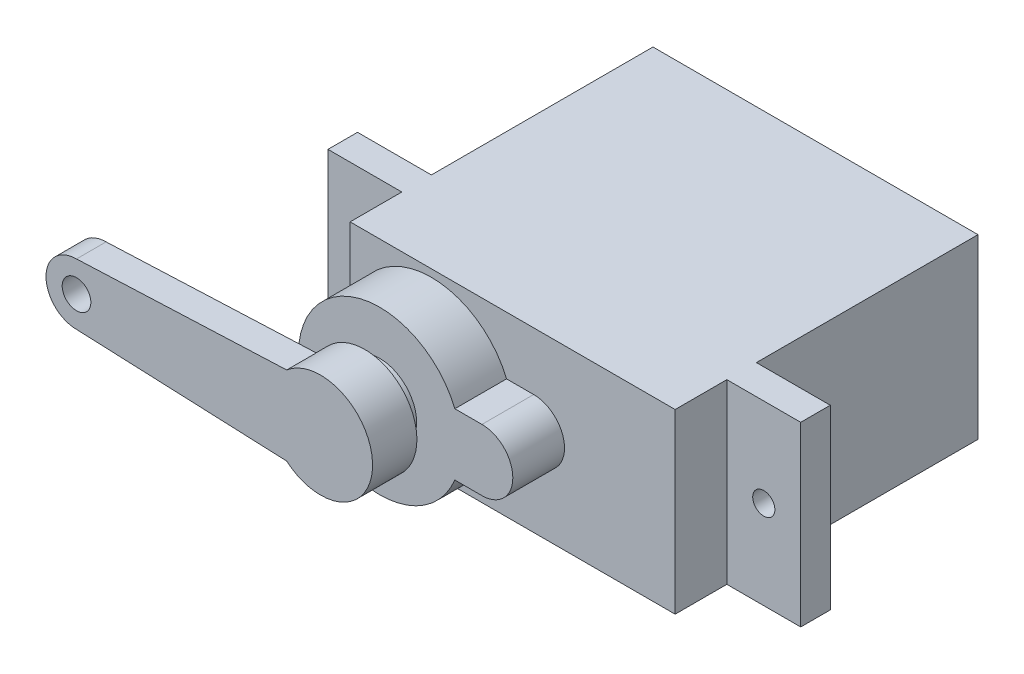
ISO-10303-21;
HEADER;
FILE_DESCRIPTION(('STEP AP214'),'2;1');
FILE_NAME('part.step','',(''),(''),'','','');
FILE_SCHEMA(('AUTOMOTIVE_DESIGN { 1 0 10303 214 1 1 1 1 }'));
ENDSEC;
DATA;
#1=APPLICATION_CONTEXT('core data for automotive mechanical design processes');
#2=APPLICATION_PROTOCOL_DEFINITION('international standard','automotive_design',2000,#1);
#3=PRODUCT_CONTEXT('',#1,'mechanical');
#4=PRODUCT('Part','Part','',(#3));
#5=PRODUCT_RELATED_PRODUCT_CATEGORY('part','',(#4));
#6=PRODUCT_DEFINITION_FORMATION('','',#4);
#7=PRODUCT_DEFINITION_CONTEXT('part definition',#1,'design');
#8=PRODUCT_DEFINITION('design','',#6,#7);
#9=PRODUCT_DEFINITION_SHAPE('','',#8);
#10=(LENGTH_UNIT() NAMED_UNIT(*) SI_UNIT(.MILLI.,.METRE.));
#11=(NAMED_UNIT(*) PLANE_ANGLE_UNIT() SI_UNIT($,.RADIAN.));
#12=(NAMED_UNIT(*) SI_UNIT($,.STERADIAN.) SOLID_ANGLE_UNIT());
#13=UNCERTAINTY_MEASURE_WITH_UNIT(LENGTH_MEASURE(1.E-05),#10,'distance_accuracy_value','');
#14=(GEOMETRIC_REPRESENTATION_CONTEXT(3) GLOBAL_UNCERTAINTY_ASSIGNED_CONTEXT((#13)) GLOBAL_UNIT_ASSIGNED_CONTEXT((#10,
#11,#12)) REPRESENTATION_CONTEXT('',''));
#15=CARTESIAN_POINT('',(0.,0.,0.));
#16=DIRECTION('',(0.,0.,1.));
#17=DIRECTION('',(1.,0.,0.));
#18=AXIS2_PLACEMENT_3D('',#15,#16,#17);
#19=CARTESIAN_POINT('',(-10.8451712141979,26.1223214401039,14.1474305796321));
#20=DIRECTION('',(0.,-3.38569450253345E-13,1.));
#21=DIRECTION('',(0.,-1.,-3.38569450253345E-13));
#22=AXIS2_PLACEMENT_3D('',#19,#20,#21);
#23=CYLINDRICAL_SURFACE('',#22,3.52);
#24=CARTESIAN_POINT('',(-10.8451712141979,26.1223214401039,14.1474305796321));
#25=DIRECTION('',(0.,-3.38569450253345E-13,1.));
#26=DIRECTION('',(0.,-1.,-3.38569450253345E-13));
#27=AXIS2_PLACEMENT_3D('',#24,#25,#26);
#28=CIRCLE('',#27,3.52);
#29=CARTESIAN_POINT('',(-10.8451712141979,22.6023214401039,14.1474305796309));
#30=VERTEX_POINT('',#29);
#31=EDGE_CURVE('E259',#30,#30,#28,.T.);
#32=ORIENTED_EDGE('',*,*,#31,.T.);
#33=EDGE_LOOP('',(#32));
#34=FACE_BOUND('',#33,.T.);
#35=CARTESIAN_POINT('',(-10.8451712141979,26.1223214401028,17.1474305796321));
#36=DIRECTION('',(0.,-3.38569450253345E-13,1.));
#37=DIRECTION('',(0.,-1.,-3.38569450253345E-13));
#38=AXIS2_PLACEMENT_3D('',#35,#36,#37);
#39=CIRCLE('',#38,3.52);
#40=CARTESIAN_POINT('',(-13.1377621669424,23.4512866736885,17.1474305796312));
#41=VERTEX_POINT('',#40);
#42=CARTESIAN_POINT('',(-13.1377621669553,28.7933562065052,17.1474305796233));
#43=VERTEX_POINT('',#42);
#44=EDGE_CURVE('E257',#41,#43,#39,.T.);
#45=ORIENTED_EDGE('',*,*,#44,.F.);
#46=DIRECTION('',(0.,0.,1.));
#47=VECTOR('',#46,1.);
#48=CARTESIAN_POINT('',(-13.1377621669486,23.4512866736888,15.1474305796233));
#49=LINE('',#48,#47);
#50=CARTESIAN_POINT('',(-13.1377621669486,23.4512866736888,15.1474305796233));
#51=VERTEX_POINT('',#50);
#52=EDGE_CURVE('E681',#51,#41,#49,.T.);
#53=ORIENTED_EDGE('',*,*,#52,.F.);
#54=CARTESIAN_POINT('',(-10.8451712141945,26.1223214400999,15.1474305796233));
#55=DIRECTION('',(0.,0.,1.));
#56=DIRECTION('',(1.,0.,0.));
#57=AXIS2_PLACEMENT_3D('',#54,#55,#56);
#58=CIRCLE('',#57,3.52000000000378);
#59=CARTESIAN_POINT('',(-13.1377621669553,28.7933562065052,15.1474305796233));
#60=VERTEX_POINT('',#59);
#61=EDGE_CURVE('E239',#60,#51,#58,.T.);
#62=ORIENTED_EDGE('',*,*,#61,.F.);
#63=DIRECTION('',(0.,0.,1.));
#64=VECTOR('',#63,1.);
#65=CARTESIAN_POINT('',(-13.1377621669553,28.7933562065052,15.1474305796233));
#66=LINE('',#65,#64);
#67=EDGE_CURVE('E250',#60,#43,#66,.T.);
#68=ORIENTED_EDGE('',*,*,#67,.T.);
#69=EDGE_LOOP('',(#45,#53,#62,#68));
#70=FACE_BOUND('',#69,.T.);
#71=ADVANCED_FACE('F79',(#34,#70),#23,.T.);
#72=CARTESIAN_POINT('',(-10.8451712141979,26.1223214401039,14.1474305796321));
#73=DIRECTION('',(0.,-3.38569450253345E-13,1.));
#74=DIRECTION('',(0.,-1.,-3.38569450253345E-13));
#75=AXIS2_PLACEMENT_3D('',#72,#73,#74);
#76=PLANE('',#75);
#77=CARTESIAN_POINT('',(-10.8451712141979,26.1223214401039,14.1474305796321));
#78=DIRECTION('',(0.,-3.38569450253345E-13,1.));
#79=DIRECTION('',(0.,-1.,-3.38569450253345E-13));
#80=AXIS2_PLACEMENT_3D('',#77,#78,#79);
#81=CIRCLE('',#80,2.5);
#82=CARTESIAN_POINT('',(-10.8451712141979,23.6223214401039,14.1474305796313));
#83=VERTEX_POINT('',#82);
#84=EDGE_CURVE('E12',#83,#83,#81,.T.);
#85=ORIENTED_EDGE('',*,*,#84,.T.);
#86=EDGE_LOOP('',(#85));
#87=FACE_BOUND('',#86,.T.);
#88=ORIENTED_EDGE('',*,*,#31,.F.);
#89=EDGE_LOOP('',(#88));
#90=FACE_BOUND('',#89,.T.);
#91=ADVANCED_FACE('F474',(#87,#90),#76,.F.);
#92=CARTESIAN_POINT('',(-10.8451712141979,26.1223214401028,17.1474305796321));
#93=DIRECTION('',(0.,-3.38569450253345E-13,1.));
#94=DIRECTION('',(0.,-1.,-3.38569450253345E-13));
#95=AXIS2_PLACEMENT_3D('',#92,#93,#94);
#96=PLANE('',#95);
#97=CARTESIAN_POINT('',(-27.3651712142003,26.1223214400971,17.1474305796233));
#98=DIRECTION('',(0.,0.,1.));
#99=DIRECTION('',(1.,0.,0.));
#100=AXIS2_PLACEMENT_3D('',#97,#98,#99);
#101=CIRCLE('',#100,0.969999999999998);
#102=CARTESIAN_POINT('',(-26.3951712142003,26.1223214400971,17.1474305796233));
#103=VERTEX_POINT('',#102);
#104=EDGE_CURVE('E675',#103,#103,#101,.T.);
#105=ORIENTED_EDGE('',*,*,#104,.F.);
#106=EDGE_LOOP('',(#105));
#107=FACE_BOUND('',#106,.T.);
#108=ORIENTED_EDGE('',*,*,#44,.T.);
#109=DIRECTION('',(-0.999095832776536,-0.0425149024291429,0.));
#110=VECTOR('',#109,1.);
#111=CARTESIAN_POINT('',(-13.1377621669553,28.7933562065052,17.1474305796233));
#112=LINE('',#111,#110);
#113=CARTESIAN_POINT('',(-27.3651712142037,28.1879318942225,17.1474305796233));
#114=VERTEX_POINT('',#113);
#115=EDGE_CURVE('E242',#43,#114,#112,.T.);
#116=ORIENTED_EDGE('',*,*,#115,.T.);
#117=CARTESIAN_POINT('',(-27.3651712142003,26.1223214400971,17.1474305796233));
#118=DIRECTION('',(0.,0.,-1.));
#119=DIRECTION('',(-1.,0.,0.));
#120=AXIS2_PLACEMENT_3D('',#117,#118,#119);
#121=CIRCLE('',#120,2.06561045412541);
#122=CARTESIAN_POINT('',(-27.365171214197,24.0567109859717,17.1474305796233));
#123=VERTEX_POINT('',#122);
#124=EDGE_CURVE('E683',#123,#114,#121,.T.);
#125=ORIENTED_EDGE('',*,*,#124,.F.);
#126=DIRECTION('',(-0.999095832776536,0.0425149024291534,0.));
#127=VECTOR('',#126,1.);
#128=CARTESIAN_POINT('',(-13.1377621669485,23.4512866736888,17.1474305796233));
#129=LINE('',#128,#127);
#130=EDGE_CURVE('E96',#41,#123,#129,.T.);
#131=ORIENTED_EDGE('',*,*,#130,.F.);
#132=EDGE_LOOP('',(#108,#116,#125,#131));
#133=FACE_BOUND('',#132,.T.);
#134=ADVANCED_FACE('F481',(#107,#133),#96,.T.);
#135=CARTESIAN_POINT('',(-10.8451712141979,26.1223214401032,16.1474305796321));
#136=DIRECTION('',(0.,3.38569450253345E-13,-1.));
#137=DIRECTION('',(0.,1.,3.38569450253345E-13));
#138=AXIS2_PLACEMENT_3D('',#135,#136,#137);
#139=CYLINDRICAL_SURFACE('',#138,2.5);
#140=CARTESIAN_POINT('',(-10.8451712141979,26.1223214401042,13.1474305796321));
#141=DIRECTION('',(0.,-3.38569450253345E-13,1.));
#142=DIRECTION('',(0.,-1.,-3.38569450253345E-13));
#143=AXIS2_PLACEMENT_3D('',#140,#141,#142);
#144=CIRCLE('',#143,2.5);
#145=CARTESIAN_POINT('',(-10.8451712141979,23.6223214401042,13.1474305796313));
#146=VERTEX_POINT('',#145);
#147=EDGE_CURVE('E88',#146,#146,#144,.T.);
#148=ORIENTED_EDGE('',*,*,#147,.T.);
#149=EDGE_LOOP('',(#148));
#150=FACE_BOUND('',#149,.T.);
#151=ORIENTED_EDGE('',*,*,#84,.F.);
#152=EDGE_LOOP('',(#151));
#153=FACE_BOUND('',#152,.T.);
#154=ADVANCED_FACE('F487',(#150,#153),#139,.T.);
#155=CARTESIAN_POINT('',(-5.34517121419788,66.4455640076976,6.14743057964577));
#156=DIRECTION('',(0.,3.38569450253345E-13,-1.));
#157=DIRECTION('',(0.,1.,3.38569450253345E-13));
#158=AXIS2_PLACEMENT_3D('',#155,#156,#157);
#159=PLANE('',#158);
#160=CARTESIAN_POINT('',(-18.8451712141979,26.1223214401066,6.14743057963212));
#161=DIRECTION('',(0.,-3.38569450253345E-13,1.));
#162=DIRECTION('',(0.,-1.,-3.38569450253345E-13));
#163=AXIS2_PLACEMENT_3D('',#160,#161,#162);
#164=CIRCLE('',#163,0.75);
#165=CARTESIAN_POINT('',(-18.8451712141979,25.3723214401066,6.14743057963186));
#166=VERTEX_POINT('',#165);
#167=EDGE_CURVE('E248',#166,#166,#164,.T.);
#168=ORIENTED_EDGE('',*,*,#167,.F.);
#169=EDGE_LOOP('',(#168));
#170=FACE_BOUND('',#169,.T.);
#171=DIRECTION('',(0.,-1.,-3.38569450253345E-13));
#172=VECTOR('',#171,1.);
#173=CARTESIAN_POINT('',(-16.3451712141979,32.1223214401066,6.14743057963414));
#174=LINE('',#173,#172);
#175=CARTESIAN_POINT('',(-16.3451712141979,32.1223214401066,6.14743057963414));
#176=VERTEX_POINT('',#175);
#177=CARTESIAN_POINT('',(-16.3451712141979,20.1223214401066,6.14743057963008));
#178=VERTEX_POINT('',#177);
#179=EDGE_CURVE('E295',#176,#178,#174,.T.);
#180=ORIENTED_EDGE('',*,*,#179,.F.);
#181=DIRECTION('',(-1.,0.,0.));
#182=VECTOR('',#181,1.);
#183=CARTESIAN_POINT('',(-16.3451712141979,32.1223214401066,6.14743057963414));
#184=LINE('',#183,#182);
#185=CARTESIAN_POINT('',(-21.3451712141979,32.1223214401066,6.14743057963414));
#186=VERTEX_POINT('',#185);
#187=EDGE_CURVE('E326',#176,#186,#184,.T.);
#188=ORIENTED_EDGE('',*,*,#187,.T.);
#189=DIRECTION('',(0.,-1.,-3.38569450253345E-13));
#190=VECTOR('',#189,1.);
#191=CARTESIAN_POINT('',(-21.3451712141979,32.1223214401066,6.14743057963414));
#192=LINE('',#191,#190);
#193=CARTESIAN_POINT('',(-21.3451712141979,20.1223214401066,6.14743057963008));
#194=VERTEX_POINT('',#193);
#195=EDGE_CURVE('E325',#186,#194,#192,.T.);
#196=ORIENTED_EDGE('',*,*,#195,.T.);
#197=DIRECTION('',(1.,0.,0.));
#198=VECTOR('',#197,1.);
#199=CARTESIAN_POINT('',(-16.3451712141979,20.1223214401066,6.14743057963008));
#200=LINE('',#199,#198);
#201=EDGE_CURVE('E329',#194,#178,#200,.T.);
#202=ORIENTED_EDGE('',*,*,#201,.T.);
#203=EDGE_LOOP('',(#180,#188,#196,#202));
#204=FACE_BOUND('',#203,.T.);
#205=ADVANCED_FACE('F411',(#170,#204),#159,.F.);
#206=CARTESIAN_POINT('',(8.15482878580212,26.1223214401066,6.14743057963212));
#207=DIRECTION('',(0.,-3.38569450253345E-13,1.));
#208=DIRECTION('',(0.,-1.,-3.38569450253345E-13));
#209=AXIS2_PLACEMENT_3D('',#206,#207,#208);
#210=CIRCLE('',#209,0.75);
#211=CARTESIAN_POINT('',(8.15482878580212,25.3723214401066,6.14743057963186));
#212=VERTEX_POINT('',#211);
#213=EDGE_CURVE('E245',#212,#212,#210,.T.);
#214=ORIENTED_EDGE('',*,*,#213,.F.);
#215=EDGE_LOOP('',(#214));
#216=FACE_BOUND('',#215,.T.);
#217=DIRECTION('',(0.,1.,3.38569450253345E-13));
#218=VECTOR('',#217,1.);
#219=CARTESIAN_POINT('',(5.65482878580212,32.1223214401066,6.14743057963414));
#220=LINE('',#219,#218);
#221=CARTESIAN_POINT('',(5.65482878580212,20.1223214401066,6.14743057963008));
#222=VERTEX_POINT('',#221);
#223=CARTESIAN_POINT('',(5.65482878580212,32.1223214401066,6.14743057963414));
#224=VERTEX_POINT('',#223);
#225=EDGE_CURVE('E308',#222,#224,#220,.T.);
#226=ORIENTED_EDGE('',*,*,#225,.F.);
#227=CARTESIAN_POINT('',(10.6548287858021,20.1223214401066,6.14743057963008));
#228=VERTEX_POINT('',#227);
#229=EDGE_CURVE('E328',#222,#228,#200,.T.);
#230=ORIENTED_EDGE('',*,*,#229,.T.);
#231=DIRECTION('',(0.,1.,3.38569450253345E-13));
#232=VECTOR('',#231,1.);
#233=CARTESIAN_POINT('',(10.6548287858021,32.1223214401066,6.14743057963414));
#234=LINE('',#233,#232);
#235=CARTESIAN_POINT('',(10.6548287858021,32.1223214401066,6.14743057963414));
#236=VERTEX_POINT('',#235);
#237=EDGE_CURVE('E331',#228,#236,#234,.T.);
#238=ORIENTED_EDGE('',*,*,#237,.T.);
#239=EDGE_CURVE('E323',#236,#224,#184,.T.);
#240=ORIENTED_EDGE('',*,*,#239,.T.);
#241=EDGE_LOOP('',(#226,#230,#238,#240));
#242=FACE_BOUND('',#241,.T.);
#243=ADVANCED_FACE('F450',(#216,#242),#159,.F.);
#244=CARTESIAN_POINT('',(-16.3451712141979,32.1223214401123,-10.8525694203659));
#245=DIRECTION('',(-1.,0.,0.));
#246=DIRECTION('',(0.,-1.,-3.38569450253345E-13));
#247=AXIS2_PLACEMENT_3D('',#244,#245,#246);
#248=PLANE('',#247);
#249=DIRECTION('',(0.,-1.,-3.38569450253345E-13));
#250=VECTOR('',#249,1.);
#251=CARTESIAN_POINT('',(-16.3451712141979,32.1223214401072,4.14743057963415));
#252=LINE('',#251,#250);
#253=CARTESIAN_POINT('',(-16.3451712141979,32.1223214401072,4.14743057963415));
#254=VERTEX_POINT('',#253);
#255=CARTESIAN_POINT('',(-16.3451712141979,20.1223214401072,4.14743057963008));
#256=VERTEX_POINT('',#255);
#257=EDGE_CURVE('E358',#254,#256,#252,.T.);
#258=ORIENTED_EDGE('',*,*,#257,.F.);
#259=DIRECTION('',(0.,-3.38569450253345E-13,1.));
#260=VECTOR('',#259,1.);
#261=CARTESIAN_POINT('',(-16.3451712141979,32.1223214401123,-10.8525694203659));
#262=LINE('',#261,#260);
#263=CARTESIAN_POINT('',(-16.3451712141979,32.1223214401123,-10.8525694203659));
#264=VERTEX_POINT('',#263);
#265=EDGE_CURVE('E376',#264,#254,#262,.T.);
#266=ORIENTED_EDGE('',*,*,#265,.F.);
#267=DIRECTION('',(0.,-1.,-3.38569450253345E-13));
#268=VECTOR('',#267,1.);
#269=CARTESIAN_POINT('',(-16.3451712141979,32.1223214401123,-10.8525694203659));
#270=LINE('',#269,#268);
#271=CARTESIAN_POINT('',(-16.3451712141979,20.1223214401123,-10.8525694203699));
#272=VERTEX_POINT('',#271);
#273=EDGE_CURVE('E359',#264,#272,#270,.T.);
#274=ORIENTED_EDGE('',*,*,#273,.T.);
#275=DIRECTION('',(0.,-3.38569450253345E-13,1.));
#276=VECTOR('',#275,1.);
#277=CARTESIAN_POINT('',(-16.3451712141979,20.1223214401123,-10.8525694203699));
#278=LINE('',#277,#276);
#279=EDGE_CURVE('E371',#272,#256,#278,.T.);
#280=ORIENTED_EDGE('',*,*,#279,.T.);
#281=EDGE_LOOP('',(#258,#266,#274,#280));
#282=FACE_BOUND('',#281,.T.);
#283=ADVANCED_FACE('F81',(#282),#248,.T.);
#284=CARTESIAN_POINT('',(-16.3451712141979,32.1223214401123,-10.8525694203659));
#285=DIRECTION('',(0.,-1.,-3.38569450253345E-13));
#286=DIRECTION('',(1.,0.,0.));
#287=AXIS2_PLACEMENT_3D('',#284,#285,#286);
#288=PLANE('',#287);
#289=ORIENTED_EDGE('',*,*,#265,.T.);
#290=DIRECTION('',(-1.,0.,0.));
#291=VECTOR('',#290,1.);
#292=CARTESIAN_POINT('',(5.65482878580212,32.1223214401072,4.14743057963415));
#293=LINE('',#292,#291);
#294=CARTESIAN_POINT('',(-21.3451712141979,32.1223214401072,4.14743057963415));
#295=VERTEX_POINT('',#294);
#296=EDGE_CURVE('E343',#254,#295,#293,.T.);
#297=ORIENTED_EDGE('',*,*,#296,.T.);
#298=DIRECTION('',(0.,3.38569450253345E-13,-1.));
#299=VECTOR('',#298,1.);
#300=CARTESIAN_POINT('',(-21.3451712141979,32.1223214401066,6.14743057963414));
#301=LINE('',#300,#299);
#302=EDGE_CURVE('E355',#186,#295,#301,.T.);
#303=ORIENTED_EDGE('',*,*,#302,.F.);
#304=ORIENTED_EDGE('',*,*,#187,.F.);
#305=DIRECTION('',(0.,3.38569450253345E-13,-1.));
#306=VECTOR('',#305,1.);
#307=CARTESIAN_POINT('',(-16.3451712141979,32.1223214401054,9.64743057963414));
#308=LINE('',#307,#306);
#309=CARTESIAN_POINT('',(-16.3451712141979,32.1223214401054,9.64743057963414));
#310=VERTEX_POINT('',#309);
#311=EDGE_CURVE('E305',#310,#176,#308,.T.);
#312=ORIENTED_EDGE('',*,*,#311,.F.);
#313=DIRECTION('',(-1.,0.,0.));
#314=VECTOR('',#313,1.);
#315=CARTESIAN_POINT('',(-16.3451712141979,32.1223214401054,9.64743057963414));
#316=LINE('',#315,#314);
#317=CARTESIAN_POINT('',(5.65482878580212,32.1223214401054,9.64743057963414));
#318=VERTEX_POINT('',#317);
#319=EDGE_CURVE('E303',#318,#310,#316,.T.);
#320=ORIENTED_EDGE('',*,*,#319,.F.);
#321=DIRECTION('',(0.,3.38569450253345E-13,-1.));
#322=VECTOR('',#321,1.);
#323=CARTESIAN_POINT('',(5.65482878580212,32.1223214401054,9.64743057963414));
#324=LINE('',#323,#322);
#325=EDGE_CURVE('E313',#318,#224,#324,.T.);
#326=ORIENTED_EDGE('',*,*,#325,.T.);
#327=ORIENTED_EDGE('',*,*,#239,.F.);
#328=DIRECTION('',(0.,3.38569450253345E-13,-1.));
#329=VECTOR('',#328,1.);
#330=CARTESIAN_POINT('',(10.6548287858021,32.1223214401066,6.14743057963414));
#331=LINE('',#330,#329);
#332=CARTESIAN_POINT('',(10.6548287858021,32.1223214401072,4.14743057963415));
#333=VERTEX_POINT('',#332);
#334=EDGE_CURVE('E334',#236,#333,#331,.T.);
#335=ORIENTED_EDGE('',*,*,#334,.T.);
#336=CARTESIAN_POINT('',(5.65482878580212,32.1223214401072,4.14743057963415));
#337=VERTEX_POINT('',#336);
#338=EDGE_CURVE('E344',#333,#337,#293,.T.);
#339=ORIENTED_EDGE('',*,*,#338,.T.);
#340=DIRECTION('',(0.,-3.38569450253345E-13,1.));
#341=VECTOR('',#340,1.);
#342=CARTESIAN_POINT('',(5.65482878580212,32.1223214401123,-10.8525694203659));
#343=LINE('',#342,#341);
#344=CARTESIAN_POINT('',(5.65482878580212,32.1223214401123,-10.8525694203659));
#345=VERTEX_POINT('',#344);
#346=EDGE_CURVE('E378',#345,#337,#343,.T.);
#347=ORIENTED_EDGE('',*,*,#346,.F.);
#348=DIRECTION('',(1.,0.,0.));
#349=VECTOR('',#348,1.);
#350=CARTESIAN_POINT('',(-16.3451712141979,32.1223214401123,-10.8525694203659));
#351=LINE('',#350,#349);
#352=EDGE_CURVE('E369',#264,#345,#351,.T.);
#353=ORIENTED_EDGE('',*,*,#352,.F.);
#354=EDGE_LOOP('',(#289,#297,#303,#304,#312,#320,#326,#327,#335,#339,#347,#353));
#355=FACE_BOUND('',#354,.T.);
#356=ADVANCED_FACE('F403',(#355),#288,.F.);
#357=CARTESIAN_POINT('',(5.65482878580212,20.1223214401123,-10.8525694203699));
#358=DIRECTION('',(1.,0.,0.));
#359=DIRECTION('',(0.,1.,3.38569450253345E-13));
#360=AXIS2_PLACEMENT_3D('',#357,#358,#359);
#361=PLANE('',#360);
#362=DIRECTION('',(0.,1.,3.38569450253345E-13));
#363=VECTOR('',#362,1.);
#364=CARTESIAN_POINT('',(5.65482878580212,20.1223214401072,4.14743057963008));
#365=LINE('',#364,#363);
#366=CARTESIAN_POINT('',(5.65482878580212,20.1223214401072,4.14743057963008));
#367=VERTEX_POINT('',#366);
#368=EDGE_CURVE('E363',#367,#337,#365,.T.);
#369=ORIENTED_EDGE('',*,*,#368,.F.);
#370=DIRECTION('',(0.,-3.38569450253345E-13,1.));
#371=VECTOR('',#370,1.);
#372=CARTESIAN_POINT('',(5.65482878580212,20.1223214401123,-10.8525694203699));
#373=LINE('',#372,#371);
#374=CARTESIAN_POINT('',(5.65482878580212,20.1223214401123,-10.8525694203699));
#375=VERTEX_POINT('',#374);
#376=EDGE_CURVE('E380',#375,#367,#373,.T.);
#377=ORIENTED_EDGE('',*,*,#376,.F.);
#378=DIRECTION('',(0.,1.,3.38569450253345E-13));
#379=VECTOR('',#378,1.);
#380=CARTESIAN_POINT('',(5.65482878580212,20.1223214401123,-10.8525694203699));
#381=LINE('',#380,#379);
#382=EDGE_CURVE('E366',#375,#345,#381,.T.);
#383=ORIENTED_EDGE('',*,*,#382,.T.);
#384=ORIENTED_EDGE('',*,*,#346,.T.);
#385=EDGE_LOOP('',(#369,#377,#383,#384));
#386=FACE_BOUND('',#385,.T.);
#387=ADVANCED_FACE('F461',(#386),#361,.T.);
#388=CARTESIAN_POINT('',(-16.3451712141979,20.1223214401123,-10.8525694203699));
#389=DIRECTION('',(0.,-1.,-3.38569450253345E-13));
#390=DIRECTION('',(1.,0.,0.));
#391=AXIS2_PLACEMENT_3D('',#388,#389,#390);
#392=PLANE('',#391);
#393=ORIENTED_EDGE('',*,*,#376,.T.);
#394=DIRECTION('',(1.,0.,0.));
#395=VECTOR('',#394,1.);
#396=CARTESIAN_POINT('',(5.65482878580212,20.1223214401072,4.14743057963008));
#397=LINE('',#396,#395);
#398=CARTESIAN_POINT('',(10.6548287858021,20.1223214401072,4.14743057963008));
#399=VERTEX_POINT('',#398);
#400=EDGE_CURVE('E337',#367,#399,#397,.T.);
#401=ORIENTED_EDGE('',*,*,#400,.T.);
#402=DIRECTION('',(0.,3.38569450253345E-13,-1.));
#403=VECTOR('',#402,1.);
#404=CARTESIAN_POINT('',(10.6548287858021,20.1223214401066,6.14743057963008));
#405=LINE('',#404,#403);
#406=EDGE_CURVE('E349',#228,#399,#405,.T.);
#407=ORIENTED_EDGE('',*,*,#406,.F.);
#408=ORIENTED_EDGE('',*,*,#229,.F.);
#409=DIRECTION('',(0.,3.38569450253345E-13,-1.));
#410=VECTOR('',#409,1.);
#411=CARTESIAN_POINT('',(5.65482878580212,20.1223214401054,9.64743057963008));
#412=LINE('',#411,#410);
#413=CARTESIAN_POINT('',(5.65482878580212,20.1223214401054,9.64743057963008));
#414=VERTEX_POINT('',#413);
#415=EDGE_CURVE('E316',#414,#222,#412,.T.);
#416=ORIENTED_EDGE('',*,*,#415,.F.);
#417=DIRECTION('',(1.,0.,0.));
#418=VECTOR('',#417,1.);
#419=CARTESIAN_POINT('',(-16.3451712141979,20.1223214401054,9.64743057963008));
#420=LINE('',#419,#418);
#421=CARTESIAN_POINT('',(-16.3451712141979,20.1223214401054,9.64743057963008));
#422=VERTEX_POINT('',#421);
#423=EDGE_CURVE('E298',#422,#414,#420,.T.);
#424=ORIENTED_EDGE('',*,*,#423,.F.);
#425=DIRECTION('',(0.,3.38569450253345E-13,-1.));
#426=VECTOR('',#425,1.);
#427=CARTESIAN_POINT('',(-16.3451712141979,20.1223214401054,9.64743057963008));
#428=LINE('',#427,#426);
#429=EDGE_CURVE('E319',#422,#178,#428,.T.);
#430=ORIENTED_EDGE('',*,*,#429,.T.);
#431=ORIENTED_EDGE('',*,*,#201,.F.);
#432=DIRECTION('',(0.,3.38569450253345E-13,-1.));
#433=VECTOR('',#432,1.);
#434=CARTESIAN_POINT('',(-21.3451712141979,20.1223214401066,6.14743057963008));
#435=LINE('',#434,#433);
#436=CARTESIAN_POINT('',(-21.3451712141979,20.1223214401072,4.14743057963008));
#437=VERTEX_POINT('',#436);
#438=EDGE_CURVE('E352',#194,#437,#435,.T.);
#439=ORIENTED_EDGE('',*,*,#438,.T.);
#440=EDGE_CURVE('E338',#437,#256,#397,.T.);
#441=ORIENTED_EDGE('',*,*,#440,.T.);
#442=ORIENTED_EDGE('',*,*,#279,.F.);
#443=DIRECTION('',(1.,0.,0.));
#444=VECTOR('',#443,1.);
#445=CARTESIAN_POINT('',(-16.3451712141979,20.1223214401123,-10.8525694203699));
#446=LINE('',#445,#444);
#447=EDGE_CURVE('E362',#272,#375,#446,.T.);
#448=ORIENTED_EDGE('',*,*,#447,.T.);
#449=EDGE_LOOP('',(#393,#401,#407,#408,#416,#424,#430,#431,#439,#441,#442,#448));
#450=FACE_BOUND('',#449,.T.);
#451=ADVANCED_FACE('F439',(#450),#392,.T.);
#452=CARTESIAN_POINT('',(-5.34517121419788,66.4455640077034,-10.8525694203542));
#453=DIRECTION('',(0.,-3.38569450253345E-13,1.));
#454=DIRECTION('',(0.,-1.,-3.38569450253345E-13));
#455=AXIS2_PLACEMENT_3D('',#452,#453,#454);
#456=PLANE('',#455);
#457=ORIENTED_EDGE('',*,*,#273,.F.);
#458=ORIENTED_EDGE('',*,*,#352,.T.);
#459=ORIENTED_EDGE('',*,*,#382,.F.);
#460=ORIENTED_EDGE('',*,*,#447,.F.);
#461=EDGE_LOOP('',(#457,#458,#459,#460));
#462=FACE_BOUND('',#461,.T.);
#463=ADVANCED_FACE('F395',(#462),#456,.F.);
#464=CARTESIAN_POINT('',(-5.34517121419788,66.4455640076983,4.14743057964576));
#465=DIRECTION('',(0.,3.38569450253345E-13,-1.));
#466=DIRECTION('',(0.,1.,3.38569450253345E-13));
#467=AXIS2_PLACEMENT_3D('',#464,#465,#466);
#468=PLANE('',#467);
#469=CARTESIAN_POINT('',(-18.8451712141979,26.1223214401072,4.14743057963211));
#470=DIRECTION('',(0.,3.38569450253345E-13,-1.));
#471=DIRECTION('',(0.,1.,3.38569450253345E-13));
#472=AXIS2_PLACEMENT_3D('',#469,#470,#471);
#473=CIRCLE('',#472,0.75);
#474=CARTESIAN_POINT('',(-18.8451712141979,26.8723214401072,4.14743057963237));
#475=VERTEX_POINT('',#474);
#476=EDGE_CURVE('E83',#475,#475,#473,.T.);
#477=ORIENTED_EDGE('',*,*,#476,.F.);
#478=EDGE_LOOP('',(#477));
#479=FACE_BOUND('',#478,.T.);
#480=ORIENTED_EDGE('',*,*,#296,.F.);
#481=ORIENTED_EDGE('',*,*,#257,.T.);
#482=ORIENTED_EDGE('',*,*,#440,.F.);
#483=DIRECTION('',(0.,-1.,-3.38569450253345E-13));
#484=VECTOR('',#483,1.);
#485=CARTESIAN_POINT('',(-21.3451712141979,32.1223214401072,4.14743057963415));
#486=LINE('',#485,#484);
#487=EDGE_CURVE('E322',#295,#437,#486,.T.);
#488=ORIENTED_EDGE('',*,*,#487,.F.);
#489=EDGE_LOOP('',(#480,#481,#482,#488));
#490=FACE_BOUND('',#489,.T.);
#491=ADVANCED_FACE('F391',(#479,#490),#468,.T.);
#492=CARTESIAN_POINT('',(-21.3451712141979,32.1223214401066,6.14743057963414));
#493=DIRECTION('',(1.,0.,0.));
#494=DIRECTION('',(0.,1.,3.38569450253345E-13));
#495=AXIS2_PLACEMENT_3D('',#492,#493,#494);
#496=PLANE('',#495);
#497=ORIENTED_EDGE('',*,*,#487,.T.);
#498=ORIENTED_EDGE('',*,*,#438,.F.);
#499=ORIENTED_EDGE('',*,*,#195,.F.);
#500=ORIENTED_EDGE('',*,*,#302,.T.);
#501=EDGE_LOOP('',(#497,#498,#499,#500));
#502=FACE_BOUND('',#501,.T.);
#503=ADVANCED_FACE('F394',(#502),#496,.F.);
#504=CARTESIAN_POINT('',(10.6548287858021,32.1223214401066,6.14743057963414));
#505=DIRECTION('',(-1.,0.,0.));
#506=DIRECTION('',(0.,-1.,-3.38569450253345E-13));
#507=AXIS2_PLACEMENT_3D('',#504,#505,#506);
#508=PLANE('',#507);
#509=DIRECTION('',(0.,1.,3.38569450253345E-13));
#510=VECTOR('',#509,1.);
#511=CARTESIAN_POINT('',(10.6548287858021,32.1223214401072,4.14743057963415));
#512=LINE('',#511,#510);
#513=EDGE_CURVE('E341',#399,#333,#512,.T.);
#514=ORIENTED_EDGE('',*,*,#513,.T.);
#515=ORIENTED_EDGE('',*,*,#334,.F.);
#516=ORIENTED_EDGE('',*,*,#237,.F.);
#517=ORIENTED_EDGE('',*,*,#406,.T.);
#518=EDGE_LOOP('',(#514,#515,#516,#517));
#519=FACE_BOUND('',#518,.T.);
#520=ADVANCED_FACE('F452',(#519),#508,.F.);
#521=CARTESIAN_POINT('',(8.15482878580212,26.1223214401072,4.14743057963211));
#522=DIRECTION('',(0.,3.38569450253345E-13,-1.));
#523=DIRECTION('',(0.,1.,3.38569450253345E-13));
#524=AXIS2_PLACEMENT_3D('',#521,#522,#523);
#525=CIRCLE('',#524,0.75);
#526=CARTESIAN_POINT('',(8.15482878580212,26.8723214401072,4.14743057963237));
#527=VERTEX_POINT('',#526);
#528=EDGE_CURVE('E255',#527,#527,#525,.T.);
#529=ORIENTED_EDGE('',*,*,#528,.F.);
#530=EDGE_LOOP('',(#529));
#531=FACE_BOUND('',#530,.T.);
#532=ORIENTED_EDGE('',*,*,#400,.F.);
#533=ORIENTED_EDGE('',*,*,#368,.T.);
#534=ORIENTED_EDGE('',*,*,#338,.F.);
#535=ORIENTED_EDGE('',*,*,#513,.F.);
#536=EDGE_LOOP('',(#532,#533,#534,#535));
#537=FACE_BOUND('',#536,.T.);
#538=ADVANCED_FACE('F397',(#531,#537),#468,.T.);
#539=CARTESIAN_POINT('',(-16.3451712141979,32.1223214401054,9.64743057963414));
#540=DIRECTION('',(1.,0.,0.));
#541=DIRECTION('',(0.,1.,3.38569450253345E-13));
#542=AXIS2_PLACEMENT_3D('',#539,#540,#541);
#543=PLANE('',#542);
#544=ORIENTED_EDGE('',*,*,#179,.T.);
#545=ORIENTED_EDGE('',*,*,#429,.F.);
#546=DIRECTION('',(0.,-1.,-3.38569450253345E-13));
#547=VECTOR('',#546,1.);
#548=CARTESIAN_POINT('',(-16.3451712141979,32.1223214401054,9.64743057963414));
#549=LINE('',#548,#547);
#550=CARTESIAN_POINT('',(-16.3451712141979,26.1223214401054,9.64743057963211));
#551=VERTEX_POINT('',#550);
#552=EDGE_CURVE('E299',#551,#422,#549,.T.);
#553=ORIENTED_EDGE('',*,*,#552,.F.);
#554=EDGE_CURVE('E296',#310,#551,#549,.T.);
#555=ORIENTED_EDGE('',*,*,#554,.F.);
#556=ORIENTED_EDGE('',*,*,#311,.T.);
#557=EDGE_LOOP('',(#544,#545,#553,#555,#556));
#558=FACE_BOUND('',#557,.T.);
#559=ADVANCED_FACE('F416',(#558),#543,.F.);
#560=CARTESIAN_POINT('',(5.65482878580212,32.1223214401054,9.64743057963414));
#561=DIRECTION('',(-1.,0.,0.));
#562=DIRECTION('',(0.,-1.,-3.38569450253345E-13));
#563=AXIS2_PLACEMENT_3D('',#560,#561,#562);
#564=PLANE('',#563);
#565=ORIENTED_EDGE('',*,*,#225,.T.);
#566=ORIENTED_EDGE('',*,*,#325,.F.);
#567=DIRECTION('',(0.,1.,3.38569450253345E-13));
#568=VECTOR('',#567,1.);
#569=CARTESIAN_POINT('',(5.65482878580212,32.1223214401054,9.64743057963414));
#570=LINE('',#569,#568);
#571=EDGE_CURVE('E301',#414,#318,#570,.T.);
#572=ORIENTED_EDGE('',*,*,#571,.F.);
#573=ORIENTED_EDGE('',*,*,#415,.T.);
#574=EDGE_LOOP('',(#565,#566,#572,#573));
#575=FACE_BOUND('',#574,.T.);
#576=ADVANCED_FACE('F445',(#575),#564,.F.);
#577=CARTESIAN_POINT('',(-5.34517121419788,66.4455640076964,9.64743057964576));
#578=DIRECTION('',(0.,-3.38569450253345E-13,1.));
#579=DIRECTION('',(0.,-1.,-3.38569450253345E-13));
#580=AXIS2_PLACEMENT_3D('',#577,#578,#579);
#581=PLANE('',#580);
#582=CARTESIAN_POINT('',(-10.8451712141979,26.1223214401054,9.64743057963211));
#583=DIRECTION('',(0.,-3.38569450253345E-13,1.));
#584=DIRECTION('',(0.,-1.,-3.38569450253345E-13));
#585=AXIS2_PLACEMENT_3D('',#582,#583,#584);
#586=CIRCLE('',#585,5.5);
#587=CARTESIAN_POINT('',(-5.75713584186817,28.2108367141509,9.64743057963282));
#588=VERTEX_POINT('',#587);
#589=EDGE_CURVE('E104',#588,#551,#586,.T.);
#590=ORIENTED_EDGE('',*,*,#589,.F.);
#591=DIRECTION('',(-1.,0.,0.));
#592=VECTOR('',#591,1.);
#593=CARTESIAN_POINT('',(-5.75713584186817,28.2108367141509,9.64743057963282));
#594=LINE('',#593,#592);
#595=CARTESIAN_POINT('',(-3.92161559971107,28.2108367141509,9.64743057963282));
#596=VERTEX_POINT('',#595);
#597=EDGE_CURVE('E269',#596,#588,#594,.T.);
#598=ORIENTED_EDGE('',*,*,#597,.F.);
#599=CARTESIAN_POINT('',(-3.92161559971107,26.1223214401054,9.64743057963211));
#600=DIRECTION('',(0.,-3.38569450253345E-13,1.));
#601=DIRECTION('',(0.,-1.,-3.38569450253345E-13));
#602=AXIS2_PLACEMENT_3D('',#599,#600,#601);
#603=CIRCLE('',#602,2.08851527404555);
#604=CARTESIAN_POINT('',(-3.92161559971107,24.0338061660598,9.64743057963141));
#605=VERTEX_POINT('',#604);
#606=EDGE_CURVE('E280',#605,#596,#603,.T.);
#607=ORIENTED_EDGE('',*,*,#606,.F.);
#608=DIRECTION('',(1.,0.,0.));
#609=VECTOR('',#608,1.);
#610=CARTESIAN_POINT('',(-5.75713584186817,24.0338061660598,9.64743057963141));
#611=LINE('',#610,#609);
#612=CARTESIAN_POINT('',(-5.75713584186817,24.0338061660598,9.64743057963141));
#613=VERTEX_POINT('',#612);
#614=EDGE_CURVE('E277',#613,#605,#611,.T.);
#615=ORIENTED_EDGE('',*,*,#614,.F.);
#616=EDGE_CURVE('E264',#551,#613,#586,.T.);
#617=ORIENTED_EDGE('',*,*,#616,.F.);
#618=ORIENTED_EDGE('',*,*,#552,.T.);
#619=ORIENTED_EDGE('',*,*,#423,.T.);
#620=ORIENTED_EDGE('',*,*,#571,.T.);
#621=ORIENTED_EDGE('',*,*,#319,.T.);
#622=ORIENTED_EDGE('',*,*,#554,.T.);
#623=EDGE_LOOP('',(#590,#598,#607,#615,#617,#618,#619,#620,#621,#622));
#624=FACE_BOUND('',#623,.T.);
#625=ADVANCED_FACE('F419',(#624),#581,.T.);
#626=CARTESIAN_POINT('',(-10.8451712141979,26.1223214401042,13.1474305796321));
#627=DIRECTION('',(0.,3.38569450253345E-13,-1.));
#628=DIRECTION('',(0.,1.,3.38569450253345E-13));
#629=AXIS2_PLACEMENT_3D('',#626,#627,#628);
#630=CYLINDRICAL_SURFACE('',#629,5.5);
#631=ORIENTED_EDGE('',*,*,#589,.T.);
#632=ORIENTED_EDGE('',*,*,#616,.T.);
#633=DIRECTION('',(0.,3.38569450253345E-13,-1.));
#634=VECTOR('',#633,1.);
#635=CARTESIAN_POINT('',(-5.75713584186817,24.0338061660586,13.1474305796314));
#636=LINE('',#635,#634);
#637=CARTESIAN_POINT('',(-5.75713584186817,24.0338061660586,13.1474305796314));
#638=VERTEX_POINT('',#637);
#639=EDGE_CURVE('E292',#638,#613,#636,.T.);
#640=ORIENTED_EDGE('',*,*,#639,.F.);
#641=CARTESIAN_POINT('',(-10.8451712141979,26.1223214401042,13.1474305796321));
#642=DIRECTION('',(0.,-3.38569450253345E-13,1.));
#643=DIRECTION('',(0.,-1.,-3.38569450253345E-13));
#644=AXIS2_PLACEMENT_3D('',#641,#642,#643);
#645=CIRCLE('',#644,5.5);
#646=CARTESIAN_POINT('',(-5.75713584186817,28.2108367141497,13.1474305796328));
#647=VERTEX_POINT('',#646);
#648=EDGE_CURVE('E265',#647,#638,#645,.T.);
#649=ORIENTED_EDGE('',*,*,#648,.F.);
#650=DIRECTION('',(0.,3.38569450253345E-13,-1.));
#651=VECTOR('',#650,1.);
#652=CARTESIAN_POINT('',(-5.75713584186817,28.2108367141497,13.1474305796328));
#653=LINE('',#652,#651);
#654=EDGE_CURVE('E275',#647,#588,#653,.T.);
#655=ORIENTED_EDGE('',*,*,#654,.T.);
#656=EDGE_LOOP('',(#631,#632,#640,#649,#655));
#657=FACE_BOUND('',#656,.T.);
#658=ADVANCED_FACE('F422',(#657),#630,.T.);
#659=CARTESIAN_POINT('',(-5.75713584186817,24.0338061660586,13.1474305796314));
#660=DIRECTION('',(0.,1.,3.38569450253345E-13));
#661=DIRECTION('',(-1.,0.,0.));
#662=AXIS2_PLACEMENT_3D('',#659,#660,#661);
#663=PLANE('',#662);
#664=ORIENTED_EDGE('',*,*,#614,.T.);
#665=DIRECTION('',(0.,3.38569450253345E-13,-1.));
#666=VECTOR('',#665,1.);
#667=CARTESIAN_POINT('',(-3.92161559971107,24.0338061660586,13.1474305796314));
#668=LINE('',#667,#666);
#669=CARTESIAN_POINT('',(-3.92161559971107,24.0338061660586,13.1474305796314));
#670=VERTEX_POINT('',#669);
#671=EDGE_CURVE('E289',#670,#605,#668,.T.);
#672=ORIENTED_EDGE('',*,*,#671,.F.);
#673=DIRECTION('',(1.,0.,0.));
#674=VECTOR('',#673,1.);
#675=CARTESIAN_POINT('',(-5.75713584186817,24.0338061660586,13.1474305796314));
#676=LINE('',#675,#674);
#677=EDGE_CURVE('E268',#638,#670,#676,.T.);
#678=ORIENTED_EDGE('',*,*,#677,.F.);
#679=ORIENTED_EDGE('',*,*,#639,.T.);
#680=EDGE_LOOP('',(#664,#672,#678,#679));
#681=FACE_BOUND('',#680,.T.);
#682=ADVANCED_FACE('F435',(#681),#663,.F.);
#683=CARTESIAN_POINT('',(-3.92161559971107,26.1223214401042,13.1474305796321));
#684=DIRECTION('',(0.,3.38569450253345E-13,-1.));
#685=DIRECTION('',(0.,1.,3.38569450253345E-13));
#686=AXIS2_PLACEMENT_3D('',#683,#684,#685);
#687=CYLINDRICAL_SURFACE('',#686,2.08851527404555);
#688=ORIENTED_EDGE('',*,*,#606,.T.);
#689=DIRECTION('',(0.,3.38569450253345E-13,-1.));
#690=VECTOR('',#689,1.);
#691=CARTESIAN_POINT('',(-3.92161559971107,28.2108367141497,13.1474305796328));
#692=LINE('',#691,#690);
#693=CARTESIAN_POINT('',(-3.92161559971107,28.2108367141497,13.1474305796328));
#694=VERTEX_POINT('',#693);
#695=EDGE_CURVE('E286',#694,#596,#692,.T.);
#696=ORIENTED_EDGE('',*,*,#695,.F.);
#697=CARTESIAN_POINT('',(-3.92161559971107,26.1223214401042,13.1474305796321));
#698=DIRECTION('',(0.,-3.38569450253345E-13,1.));
#699=DIRECTION('',(0.,-1.,-3.38569450253345E-13));
#700=AXIS2_PLACEMENT_3D('',#697,#698,#699);
#701=CIRCLE('',#700,2.08851527404555);
#702=EDGE_CURVE('E271',#670,#694,#701,.T.);
#703=ORIENTED_EDGE('',*,*,#702,.F.);
#704=ORIENTED_EDGE('',*,*,#671,.T.);
#705=EDGE_LOOP('',(#688,#696,#703,#704));
#706=FACE_BOUND('',#705,.T.);
#707=ADVANCED_FACE('F431',(#706),#687,.T.);
#708=CARTESIAN_POINT('',(-5.75713584186817,28.2108367141497,13.1474305796328));
#709=DIRECTION('',(0.,-1.,-3.38569450253345E-13));
#710=DIRECTION('',(1.,0.,0.));
#711=AXIS2_PLACEMENT_3D('',#708,#709,#710);
#712=PLANE('',#711);
#713=ORIENTED_EDGE('',*,*,#597,.T.);
#714=ORIENTED_EDGE('',*,*,#654,.F.);
#715=DIRECTION('',(-1.,0.,0.));
#716=VECTOR('',#715,1.);
#717=CARTESIAN_POINT('',(-5.75713584186817,28.2108367141497,13.1474305796328));
#718=LINE('',#717,#716);
#719=EDGE_CURVE('E273',#694,#647,#718,.T.);
#720=ORIENTED_EDGE('',*,*,#719,.F.);
#721=ORIENTED_EDGE('',*,*,#695,.T.);
#722=EDGE_LOOP('',(#713,#714,#720,#721));
#723=FACE_BOUND('',#722,.T.);
#724=ADVANCED_FACE('F428',(#723),#712,.F.);
#725=CARTESIAN_POINT('',(-10.8451712141979,26.1223214401042,13.1474305796321));
#726=DIRECTION('',(0.,-3.38569450253345E-13,1.));
#727=DIRECTION('',(0.,-1.,-3.38569450253345E-13));
#728=AXIS2_PLACEMENT_3D('',#725,#726,#727);
#729=PLANE('',#728);
#730=ORIENTED_EDGE('',*,*,#147,.F.);
#731=EDGE_LOOP('',(#730));
#732=FACE_BOUND('',#731,.T.);
#733=ORIENTED_EDGE('',*,*,#648,.T.);
#734=ORIENTED_EDGE('',*,*,#677,.T.);
#735=ORIENTED_EDGE('',*,*,#702,.T.);
#736=ORIENTED_EDGE('',*,*,#719,.T.);
#737=EDGE_LOOP('',(#733,#734,#735,#736));
#738=FACE_BOUND('',#737,.T.);
#739=ADVANCED_FACE('F491',(#732,#738),#729,.T.);
#740=CARTESIAN_POINT('',(8.15482878580212,26.1223214401096,-2.85256942036789));
#741=DIRECTION('',(0.,-3.38569450253345E-13,1.));
#742=DIRECTION('',(0.,-1.,-3.38569450253345E-13));
#743=AXIS2_PLACEMENT_3D('',#740,#741,#742);
#744=CYLINDRICAL_SURFACE('',#743,0.75);
#745=ORIENTED_EDGE('',*,*,#528,.T.);
#746=EDGE_LOOP('',(#745));
#747=FACE_BOUND('',#746,.T.);
#748=ORIENTED_EDGE('',*,*,#213,.T.);
#749=EDGE_LOOP('',(#748));
#750=FACE_BOUND('',#749,.T.);
#751=ADVANCED_FACE('F494',(#747,#750),#744,.F.);
#752=CARTESIAN_POINT('',(-18.8451712141979,26.1223214401096,-2.85256942036789));
#753=DIRECTION('',(0.,-3.38569450253345E-13,1.));
#754=DIRECTION('',(0.,-1.,-3.38569450253345E-13));
#755=AXIS2_PLACEMENT_3D('',#752,#753,#754);
#756=CYLINDRICAL_SURFACE('',#755,0.75);
#757=ORIENTED_EDGE('',*,*,#476,.T.);
#758=EDGE_LOOP('',(#757));
#759=FACE_BOUND('',#758,.T.);
#760=ORIENTED_EDGE('',*,*,#167,.T.);
#761=EDGE_LOOP('',(#760));
#762=FACE_BOUND('',#761,.T.);
#763=ADVANCED_FACE('F388',(#759,#762),#756,.F.);
#764=CARTESIAN_POINT('',(-13.1377621669485,23.4512866736888,15.1474305796233));
#765=DIRECTION('',(0.0425149024291534,0.999095832776536,0.));
#766=DIRECTION('',(-0.999095832776536,0.0425149024291534,0.));
#767=AXIS2_PLACEMENT_3D('',#764,#765,#766);
#768=PLANE('',#767);
#769=ORIENTED_EDGE('',*,*,#130,.T.);
#770=DIRECTION('',(0.,0.,1.));
#771=VECTOR('',#770,1.);
#772=CARTESIAN_POINT('',(-27.365171214197,24.0567109859717,15.1474305796233));
#773=LINE('',#772,#771);
#774=CARTESIAN_POINT('',(-27.365171214197,24.0567109859717,15.1474305796233));
#775=VERTEX_POINT('',#774);
#776=EDGE_CURVE('E228',#775,#123,#773,.T.);
#777=ORIENTED_EDGE('',*,*,#776,.F.);
#778=DIRECTION('',(-0.999095832776536,0.0425149024291534,0.));
#779=VECTOR('',#778,1.);
#780=CARTESIAN_POINT('',(-13.1377621669485,23.4512866736888,15.1474305796233));
#781=LINE('',#780,#779);
#782=EDGE_CURVE('E234',#51,#775,#781,.T.);
#783=ORIENTED_EDGE('',*,*,#782,.F.);
#784=ORIENTED_EDGE('',*,*,#52,.T.);
#785=EDGE_LOOP('',(#769,#777,#783,#784));
#786=FACE_BOUND('',#785,.T.);
#787=ADVANCED_FACE('F244',(#786),#768,.F.);
#788=CARTESIAN_POINT('',(-27.3651712142003,26.1223214400971,15.1474305796233));
#789=DIRECTION('',(0.,0.,1.));
#790=DIRECTION('',(1.,0.,0.));
#791=AXIS2_PLACEMENT_3D('',#788,#789,#790);
#792=CYLINDRICAL_SURFACE('',#791,2.06561045412541);
#793=ORIENTED_EDGE('',*,*,#124,.T.);
#794=DIRECTION('',(0.,0.,1.));
#795=VECTOR('',#794,1.);
#796=CARTESIAN_POINT('',(-27.3651712142037,28.1879318942225,15.1474305796233));
#797=LINE('',#796,#795);
#798=CARTESIAN_POINT('',(-27.3651712142037,28.1879318942225,15.1474305796233));
#799=VERTEX_POINT('',#798);
#800=EDGE_CURVE('E229',#799,#114,#797,.T.);
#801=ORIENTED_EDGE('',*,*,#800,.F.);
#802=CARTESIAN_POINT('',(-27.3651712142003,26.1223214400971,15.1474305796233));
#803=DIRECTION('',(0.,0.,-1.));
#804=DIRECTION('',(-1.,0.,0.));
#805=AXIS2_PLACEMENT_3D('',#802,#803,#804);
#806=CIRCLE('',#805,2.06561045412541);
#807=EDGE_CURVE('E223',#775,#799,#806,.T.);
#808=ORIENTED_EDGE('',*,*,#807,.F.);
#809=ORIENTED_EDGE('',*,*,#776,.T.);
#810=EDGE_LOOP('',(#793,#801,#808,#809));
#811=FACE_BOUND('',#810,.T.);
#812=ADVANCED_FACE('F226',(#811),#792,.T.);
#813=CARTESIAN_POINT('',(-13.1377621669553,28.7933562065052,15.1474305796233));
#814=DIRECTION('',(-0.0425149024291429,0.999095832776536,0.));
#815=DIRECTION('',(-0.999095832776536,-0.0425149024291429,0.));
#816=AXIS2_PLACEMENT_3D('',#813,#814,#815);
#817=PLANE('',#816);
#818=ORIENTED_EDGE('',*,*,#115,.F.);
#819=ORIENTED_EDGE('',*,*,#67,.F.);
#820=DIRECTION('',(-0.999095832776536,-0.0425149024291429,0.));
#821=VECTOR('',#820,1.);
#822=CARTESIAN_POINT('',(-13.1377621669553,28.7933562065052,15.1474305796233));
#823=LINE('',#822,#821);
#824=EDGE_CURVE('E233',#60,#799,#823,.T.);
#825=ORIENTED_EDGE('',*,*,#824,.T.);
#826=ORIENTED_EDGE('',*,*,#800,.T.);
#827=EDGE_LOOP('',(#818,#819,#825,#826));
#828=FACE_BOUND('',#827,.T.);
#829=ADVANCED_FACE('F640',(#828),#817,.T.);
#830=CARTESIAN_POINT('',(-27.3651712142003,26.1223214400971,15.1474305796233));
#831=DIRECTION('',(0.,0.,-1.));
#832=DIRECTION('',(-1.,0.,0.));
#833=AXIS2_PLACEMENT_3D('',#830,#831,#832);
#834=PLANE('',#833);
#835=CARTESIAN_POINT('',(-27.3651712142003,26.1223214400971,15.1474305796233));
#836=DIRECTION('',(0.,0.,1.));
#837=DIRECTION('',(1.,0.,0.));
#838=AXIS2_PLACEMENT_3D('',#835,#836,#837);
#839=CIRCLE('',#838,0.969999999999998);
#840=CARTESIAN_POINT('',(-26.3951712142003,26.1223214400971,15.1474305796233));
#841=VERTEX_POINT('',#840);
#842=EDGE_CURVE('E672',#841,#841,#839,.T.);
#843=ORIENTED_EDGE('',*,*,#842,.T.);
#844=EDGE_LOOP('',(#843));
#845=FACE_BOUND('',#844,.T.);
#846=ORIENTED_EDGE('',*,*,#782,.T.);
#847=ORIENTED_EDGE('',*,*,#807,.T.);
#848=ORIENTED_EDGE('',*,*,#824,.F.);
#849=ORIENTED_EDGE('',*,*,#61,.T.);
#850=EDGE_LOOP('',(#846,#847,#848,#849));
#851=FACE_BOUND('',#850,.T.);
#852=ADVANCED_FACE('F237',(#845,#851),#834,.T.);
#853=CARTESIAN_POINT('',(-27.3651712142003,26.1223214400971,15.1474305796233));
#854=DIRECTION('',(0.,0.,1.));
#855=DIRECTION('',(1.,0.,0.));
#856=AXIS2_PLACEMENT_3D('',#853,#854,#855);
#857=CYLINDRICAL_SURFACE('',#856,0.969999999999998);
#858=ORIENTED_EDGE('',*,*,#842,.F.);
#859=EDGE_LOOP('',(#858));
#860=FACE_BOUND('',#859,.T.);
#861=ORIENTED_EDGE('',*,*,#104,.T.);
#862=EDGE_LOOP('',(#861));
#863=FACE_BOUND('',#862,.T.);
#864=ADVANCED_FACE('F656',(#860,#863),#857,.F.);
#865=CLOSED_SHELL('',(#71,#91,#134,#154,#205,#243,#283,#356,#387,#451,#463,#491,#503,#520,#538,
#559,#576,#625,#658,#682,#707,#724,#739,#751,#763,#787,#812,#829,#852,#864));
#866=MANIFOLD_SOLID_BREP('B2',#865);
#867=ADVANCED_BREP_SHAPE_REPRESENTATION('',(#18,#866),#14);
#868=SHAPE_DEFINITION_REPRESENTATION(#9,#867);
ENDSEC;
END-ISO-10303-21;
